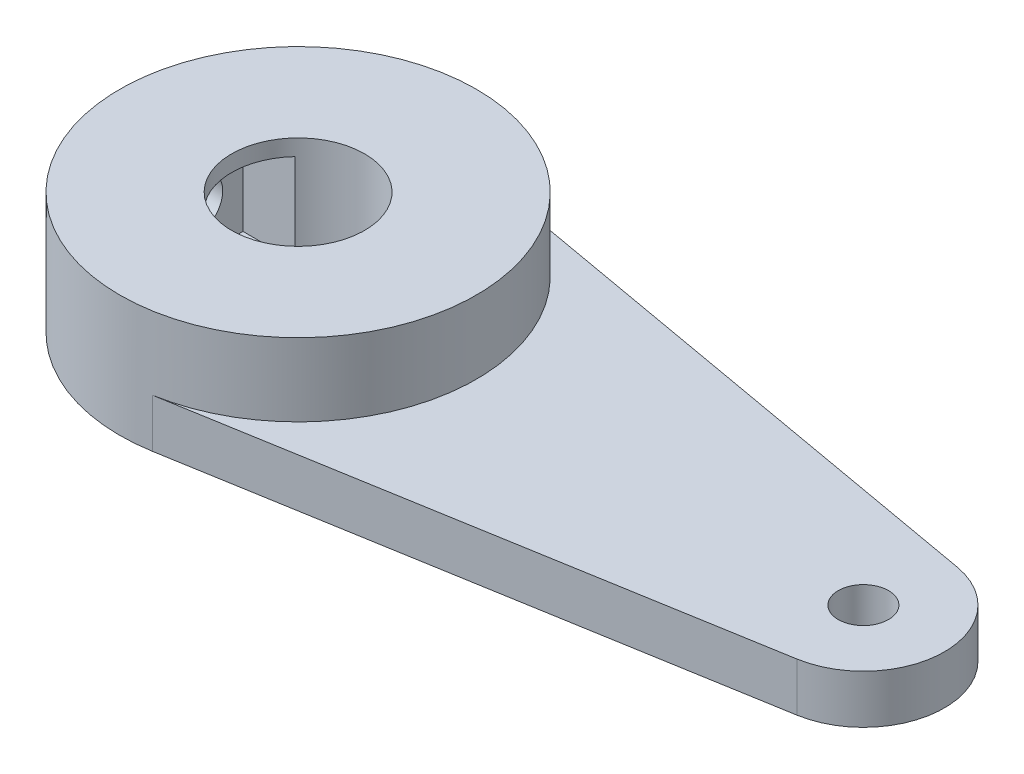
ISO-10303-21;
HEADER;
FILE_DESCRIPTION(('STEP AP214'),'2;1');
FILE_NAME('part.step','',(''),(''),'','','');
FILE_SCHEMA(('AUTOMOTIVE_DESIGN { 1 0 10303 214 1 1 1 1 }'));
ENDSEC;
DATA;
#1=APPLICATION_CONTEXT('core data for automotive mechanical design processes');
#2=APPLICATION_PROTOCOL_DEFINITION('international standard','automotive_design',2000,#1);
#3=PRODUCT_CONTEXT('',#1,'mechanical');
#4=PRODUCT('Part','Part','',(#3));
#5=PRODUCT_RELATED_PRODUCT_CATEGORY('part','',(#4));
#6=PRODUCT_DEFINITION_FORMATION('','',#4);
#7=PRODUCT_DEFINITION_CONTEXT('part definition',#1,'design');
#8=PRODUCT_DEFINITION('design','',#6,#7);
#9=PRODUCT_DEFINITION_SHAPE('','',#8);
#10=(LENGTH_UNIT() NAMED_UNIT(*) SI_UNIT(.MILLI.,.METRE.));
#11=(NAMED_UNIT(*) PLANE_ANGLE_UNIT() SI_UNIT($,.RADIAN.));
#12=(NAMED_UNIT(*) SI_UNIT($,.STERADIAN.) SOLID_ANGLE_UNIT());
#13=UNCERTAINTY_MEASURE_WITH_UNIT(LENGTH_MEASURE(1.E-05),#10,'distance_accuracy_value','');
#14=(GEOMETRIC_REPRESENTATION_CONTEXT(3) GLOBAL_UNCERTAINTY_ASSIGNED_CONTEXT((#13)) GLOBAL_UNIT_ASSIGNED_CONTEXT((#10,
#11,#12)) REPRESENTATION_CONTEXT('',''));
#15=CARTESIAN_POINT('',(0.,0.,0.));
#16=DIRECTION('',(0.,0.,1.));
#17=DIRECTION('',(1.,0.,0.));
#18=AXIS2_PLACEMENT_3D('',#15,#16,#17);
#19=CARTESIAN_POINT('',(0.,3.,0.));
#20=DIRECTION('',(0.,-1.,0.));
#21=DIRECTION('',(0.,0.,-1.));
#22=AXIS2_PLACEMENT_3D('',#19,#20,#21);
#23=CYLINDRICAL_SURFACE('',#22,11.);
#24=CARTESIAN_POINT('',(-11.,2.15,0.));
#25=CARTESIAN_POINT('',(-10.999998672925,2.15000361570064,-0.0866040264908461));
#26=CARTESIAN_POINT('',(-10.9989664869563,2.15728280643543,-0.173259794626831));
#27=CARTESIAN_POINT('',(-10.9949482100143,2.18620223688388,-0.344153330429826));
#28=CARTESIAN_POINT('',(-10.9919601636256,2.20785684905631,-0.428388590064779));
#29=CARTESIAN_POINT('',(-10.9843662745584,2.26487074748938,-0.591942867532755));
#30=CARTESIAN_POINT('',(-10.9797616037502,2.30022010851824,-0.671265397672689));
#31=CARTESIAN_POINT('',(-10.9694445515703,2.38359675135245,-0.82283940083507));
#32=CARTESIAN_POINT('',(-10.9637323378879,2.43162211432342,-0.895091941812521));
#33=CARTESIAN_POINT('',(-10.9517921420267,2.53934243122362,-1.03098880457318));
#34=CARTESIAN_POINT('',(-10.945561185276,2.59910780054263,-1.09457705522546));
#35=CARTESIAN_POINT('',(-10.9333093188318,2.72846016726637,-1.21085684580095));
#36=CARTESIAN_POINT('',(-10.9272884206848,2.79804770352853,-1.26354778749173));
#37=CARTESIAN_POINT('',(-10.9161094077342,2.94544129041762,-1.35675208502266));
#38=CARTESIAN_POINT('',(-10.910955134486,3.02328156273434,-1.39721182318942));
#39=CARTESIAN_POINT('',(-10.902133119172,3.18473724933349,-1.46446265999459));
#40=CARTESIAN_POINT('',(-10.8984653056527,3.26835238579418,-1.49125441566378));
#41=CARTESIAN_POINT('',(-10.8930604704617,3.43839728152154,-1.53023599682836));
#42=CARTESIAN_POINT('',(-10.8913108222432,3.52480473225743,-1.5425213541803));
#43=CARTESIAN_POINT('',(-10.8899019866824,3.69847116118864,-1.55243722231747));
#44=CARTESIAN_POINT('',(-10.890242693197,3.78573009592304,-1.5500684772021));
#45=CARTESIAN_POINT('',(-10.8929645198383,3.95795119210427,-1.53082158306399));
#46=CARTESIAN_POINT('',(-10.8953307405418,4.04292546308658,-1.51404938113104));
#47=CARTESIAN_POINT('',(-10.9018137246243,4.20884142025132,-1.46663731432665));
#48=CARTESIAN_POINT('',(-10.9059305321673,4.2897830046392,-1.43599709959037));
#49=CARTESIAN_POINT('',(-10.9154674597461,4.44566090916432,-1.36160716939729));
#50=CARTESIAN_POINT('',(-10.920892072566,4.52057531408944,-1.31781213197892));
#51=CARTESIAN_POINT('',(-10.9324300673764,4.66203191903368,-1.21838806763531));
#52=CARTESIAN_POINT('',(-10.9385434893145,4.72857363300284,-1.16275835418954));
#53=CARTESIAN_POINT('',(-10.9508362680828,4.85201037141765,-1.04066034641347));
#54=CARTESIAN_POINT('',(-10.9570157312566,4.90881523271891,-0.974100871831585));
#55=CARTESIAN_POINT('',(-10.9686941635756,5.01046132800483,-0.832344701826548));
#56=CARTESIAN_POINT('',(-10.9741931303394,5.05530252012217,-0.757147976178332));
#57=CARTESIAN_POINT('',(-10.9838957854881,5.13175127238931,-0.600177025011197));
#58=CARTESIAN_POINT('',(-10.9880988420774,5.16335238028128,-0.518399615630176));
#59=CARTESIAN_POINT('',(-10.9947306787688,5.21234816595864,-0.350626424965284));
#60=CARTESIAN_POINT('',(-10.9971595646028,5.22974369033481,-0.264630895386803));
#61=CARTESIAN_POINT('',(-10.9999554893663,5.24971578855354,-0.0916412747048413));
#62=CARTESIAN_POINT('',(-11.0003397874951,5.25241641247539,-0.00466177390345783));
#63=CARTESIAN_POINT('',(-10.9990500716365,5.24325058739078,0.168508732856678));
#64=CARTESIAN_POINT('',(-10.9973761136821,5.23138453493984,0.254699760216063));
#65=CARTESIAN_POINT('',(-10.9921686644742,5.19352531364729,0.423474653918695));
#66=CARTESIAN_POINT('',(-10.9886430654084,5.16759208756554,0.506072230830925));
#67=CARTESIAN_POINT('',(-10.9801265962505,5.10239753699855,0.665746677944593));
#68=CARTESIAN_POINT('',(-10.9751356644738,5.0631356514217,0.742823315567664));
#69=CARTESIAN_POINT('',(-10.9642008521073,4.97210376434156,0.889816734561455));
#70=CARTESIAN_POINT('',(-10.9582510145372,4.9202544744585,0.959683962168675));
#71=CARTESIAN_POINT('',(-10.9460805582873,4.80563065771206,1.08976922149313));
#72=CARTESIAN_POINT('',(-10.9398599258206,4.74285557409361,1.14998676118245));
#73=CARTESIAN_POINT('',(-10.9277948151625,4.60761205623004,1.25951036751739));
#74=CARTESIAN_POINT('',(-10.9219534122386,4.53507624633949,1.30873362586126));
#75=CARTESIAN_POINT('',(-10.9113611444075,4.38269334147099,1.39429716907009));
#76=CARTESIAN_POINT('',(-10.906610252839,4.30284642530513,1.43063776890808));
#77=CARTESIAN_POINT('',(-10.8987587198508,4.13836255809665,1.48927386236083));
#78=CARTESIAN_POINT('',(-10.8956528232782,4.05374182809164,1.51161412432486));
#79=CARTESIAN_POINT('',(-10.89142856138,3.88190287242822,1.54175856090802));
#80=CARTESIAN_POINT('',(-10.890310076226,3.79468480369545,1.54956361191048));
#81=CARTESIAN_POINT('',(-10.8901913855878,3.62095169802355,1.55039704678824));
#82=CARTESIAN_POINT('',(-10.8911725223973,3.53443726980281,1.54355558262746));
#83=CARTESIAN_POINT('',(-10.8951021462507,3.36380190651386,1.51556783361755));
#84=CARTESIAN_POINT('',(-10.8980506315503,3.27968096932366,1.49442156145098));
#85=CARTESIAN_POINT('',(-10.9055764978237,3.11624931636455,1.43846848261944));
#86=CARTESIAN_POINT('',(-10.9101529220596,3.03693580725103,1.40366969828592));
#87=CARTESIAN_POINT('',(-10.9204203284971,2.88525214861912,1.32141223851242));
#88=CARTESIAN_POINT('',(-10.9261113394141,2.81288217806173,1.27395323689028));
#89=CARTESIAN_POINT('',(-10.9380270606933,2.67647697474319,1.16724566741457));
#90=CARTESIAN_POINT('',(-10.944255891724,2.61251771528433,1.10790043280045));
#91=CARTESIAN_POINT('',(-10.9565102460325,2.49541827497348,0.979308846420642));
#92=CARTESIAN_POINT('',(-10.9625357214848,2.44228062457565,0.910060185331665));
#93=CARTESIAN_POINT('',(-10.9737373767081,2.34810684593979,0.763236753228444));
#94=CARTESIAN_POINT('',(-10.9789093113759,2.30713044157717,0.685623362033751));
#95=CARTESIAN_POINT('',(-10.9877791444811,2.23885454721489,0.52458254658608));
#96=CARTESIAN_POINT('',(-10.991478597728,2.21154062298357,0.441161364823184));
#97=CARTESIAN_POINT('',(-10.9961238598794,2.17769373882488,0.297785879526305));
#98=CARTESIAN_POINT('',(-10.9975700961975,2.16732408927133,0.238724404122719));
#99=CARTESIAN_POINT('',(-10.9995086202997,2.15347600496575,0.119783532123804));
#100=CARTESIAN_POINT('',(-11.0000009179399,2.14999749901407,0.0599041439856297));
#101=CARTESIAN_POINT('',(-11.,2.15,0.));
#102=B_SPLINE_CURVE_WITH_KNOTS('',3,(#24,#25,#26,#27,#28,#29,#30,#31,#32,#33,#34,#35,#36,#37,
#38,#39,#40,#41,#42,#43,#44,#45,#46,#47,#48,#49,#50,#51,#52,#53,#54,#55,#56,#57,#58,#59,#60,#61,
#62,#63,#64,#65,#66,#67,#68,#69,#70,#71,#72,#73,#74,#75,#76,#77,#78,#79,#80,#81,#82,#83,#84,#85,
#86,#87,#88,#89,#90,#91,#92,#93,#94,#95,#96,#97,#98,#99,#100,#101),.UNSPECIFIED.,.T.,.F.,(4,2,2,
2,2,2,2,2,2,2,2,2,2,2,2,2,2,2,2,2,2,2,2,2,2,2,2,2,2,2,2,2,2,2,2,2,2,2,4),(0.,0.259593216845466,
0.519446365076941,0.779111536704161,1.03873742394281,1.2999708822415,1.56121867773751,
1.82359562543898,2.08595995928316,2.34658668231909,2.60720017147757,2.86591293444981,
3.12463222464023,3.38425330169916,3.64388944328776,3.90581324569052,4.16773796469342,
4.4297901787775,4.6918267745534,4.95164786161353,5.2114618755981,5.47017737412035,
5.72890376504332,5.98930421074471,6.24971792978218,6.5120314664615,6.77433858929474,
7.0358026044493,7.29725085443003,7.55638547009205,7.81551985600735,8.07450219988342,
8.33349121691325,8.5946789137681,8.85592761509376,9.11843884929079,9.38067215491185,
9.56023505450156,9.73979609882838),.UNSPECIFIED.);
#103=CARTESIAN_POINT('',(-11.,2.15,0.));
#104=VERTEX_POINT('',#103);
#105=EDGE_CURVE('E132',#104,#104,#102,.T.);
#106=ORIENTED_EDGE('',*,*,#105,.T.);
#107=EDGE_LOOP('',(#106));
#108=FACE_BOUND('',#107,.T.);
#109=CARTESIAN_POINT('',(0.,0.,0.));
#110=DIRECTION('',(0.,1.,0.));
#111=DIRECTION('',(0.,0.,1.));
#112=AXIS2_PLACEMENT_3D('',#109,#110,#111);
#113=CIRCLE('',#112,11.);
#114=CARTESIAN_POINT('',(1.92456037559768,0.,-10.8303308980233));
#115=VERTEX_POINT('',#114);
#116=CARTESIAN_POINT('',(1.84681967687242,0.,10.8438580349024));
#117=VERTEX_POINT('',#116);
#118=EDGE_CURVE('E165',#115,#117,#113,.T.);
#119=ORIENTED_EDGE('',*,*,#118,.T.);
#120=DIRECTION('',(0.,-1.,0.));
#121=VECTOR('',#120,1.);
#122=CARTESIAN_POINT('',(1.84681967687242,3.,10.8438580349024));
#123=LINE('',#122,#121);
#124=CARTESIAN_POINT('',(1.84681967687242,3.,10.8438580349024));
#125=VERTEX_POINT('',#124);
#126=EDGE_CURVE('E186',#125,#117,#123,.T.);
#127=ORIENTED_EDGE('',*,*,#126,.F.);
#128=CARTESIAN_POINT('',(0.,3.,0.));
#129=DIRECTION('',(0.,1.,0.));
#130=DIRECTION('',(0.,0.,1.));
#131=AXIS2_PLACEMENT_3D('',#128,#129,#130);
#132=CIRCLE('',#131,11.);
#133=CARTESIAN_POINT('',(1.92456037559768,3.,-10.8303308980233));
#134=VERTEX_POINT('',#133);
#135=EDGE_CURVE('E161',#125,#134,#132,.T.);
#136=ORIENTED_EDGE('',*,*,#135,.T.);
#137=DIRECTION('',(0.,-1.,0.));
#138=VECTOR('',#137,1.);
#139=CARTESIAN_POINT('',(1.92456037559768,3.,-10.8303308980233));
#140=LINE('',#139,#138);
#141=EDGE_CURVE('E172',#134,#115,#140,.T.);
#142=ORIENTED_EDGE('',*,*,#141,.T.);
#143=EDGE_LOOP('',(#119,#127,#136,#142));
#144=FACE_BOUND('',#143,.T.);
#145=CARTESIAN_POINT('',(0.,7.5,0.));
#146=DIRECTION('',(0.,1.,0.));
#147=DIRECTION('',(0.,0.,1.));
#148=AXIS2_PLACEMENT_3D('',#145,#146,#147);
#149=CIRCLE('',#148,11.);
#150=CARTESIAN_POINT('',(0.,7.5,11.));
#151=VERTEX_POINT('',#150);
#152=EDGE_CURVE('E162',#151,#151,#149,.T.);
#153=ORIENTED_EDGE('',*,*,#152,.F.);
#154=EDGE_LOOP('',(#153));
#155=FACE_BOUND('',#154,.T.);
#156=ADVANCED_FACE('F38',(#108,#144,#155),#23,.T.);
#157=CARTESIAN_POINT('',(35.8394634894875,3.,5.05456392389569));
#158=DIRECTION('',(-0.167892697897493,0.,-0.985805275900216));
#159=DIRECTION('',(-0.985805275900216,0.,0.167892697897493));
#160=AXIS2_PLACEMENT_3D('',#157,#158,#159);
#161=PLANE('',#160);
#162=DIRECTION('',(0.985805275900216,0.,-0.167892697897493));
#163=VECTOR('',#162,1.);
#164=CARTESIAN_POINT('',(35.8394634894875,0.,5.05456392389569));
#165=LINE('',#164,#163);
#166=CARTESIAN_POINT('',(35.8394634894875,0.,5.05456392389569));
#167=VERTEX_POINT('',#166);
#168=EDGE_CURVE('E175',#117,#167,#165,.T.);
#169=ORIENTED_EDGE('',*,*,#168,.T.);
#170=DIRECTION('',(0.,-1.,0.));
#171=VECTOR('',#170,1.);
#172=CARTESIAN_POINT('',(35.8394634894875,3.,5.05456392389569));
#173=LINE('',#172,#171);
#174=CARTESIAN_POINT('',(35.8394634894875,3.,5.05456392389569));
#175=VERTEX_POINT('',#174);
#176=EDGE_CURVE('E183',#175,#167,#173,.T.);
#177=ORIENTED_EDGE('',*,*,#176,.F.);
#178=DIRECTION('',(0.985805275900216,0.,-0.167892697897493));
#179=VECTOR('',#178,1.);
#180=CARTESIAN_POINT('',(35.8394634894875,3.,5.05456392389569));
#181=LINE('',#180,#179);
#182=EDGE_CURVE('E87',#125,#175,#181,.T.);
#183=ORIENTED_EDGE('',*,*,#182,.F.);
#184=ORIENTED_EDGE('',*,*,#126,.T.);
#185=EDGE_LOOP('',(#169,#177,#183,#184));
#186=FACE_BOUND('',#185,.T.);
#187=ADVANCED_FACE('F211',(#186),#161,.F.);
#188=CARTESIAN_POINT('',(35.,3.,0.125537544394609));
#189=DIRECTION('',(0.,-1.,0.));
#190=DIRECTION('',(0.,0.,-1.));
#191=AXIS2_PLACEMENT_3D('',#188,#189,#190);
#192=CYLINDRICAL_SURFACE('',#191,5.);
#193=CARTESIAN_POINT('',(35.,0.,0.125537544394609));
#194=DIRECTION('',(0.,1.,0.));
#195=DIRECTION('',(0.,0.,-1.));
#196=AXIS2_PLACEMENT_3D('',#193,#194,#195);
#197=CIRCLE('',#196,5.);
#198=CARTESIAN_POINT('',(35.8748001707262,0.,-4.79734013652509));
#199=VERTEX_POINT('',#198);
#200=EDGE_CURVE('E177',#167,#199,#197,.T.);
#201=ORIENTED_EDGE('',*,*,#200,.T.);
#202=DIRECTION('',(0.,-1.,0.));
#203=VECTOR('',#202,1.);
#204=CARTESIAN_POINT('',(35.8748001707262,3.,-4.79734013652509));
#205=LINE('',#204,#203);
#206=CARTESIAN_POINT('',(35.8748001707262,3.,-4.79734013652509));
#207=VERTEX_POINT('',#206);
#208=EDGE_CURVE('E181',#207,#199,#205,.T.);
#209=ORIENTED_EDGE('',*,*,#208,.F.);
#210=CARTESIAN_POINT('',(35.,3.,0.125537544394609));
#211=DIRECTION('',(0.,1.,0.));
#212=DIRECTION('',(0.,0.,-1.));
#213=AXIS2_PLACEMENT_3D('',#210,#211,#212);
#214=CIRCLE('',#213,5.);
#215=EDGE_CURVE('E169',#175,#207,#214,.T.);
#216=ORIENTED_EDGE('',*,*,#215,.F.);
#217=ORIENTED_EDGE('',*,*,#176,.T.);
#218=EDGE_LOOP('',(#201,#209,#216,#217));
#219=FACE_BOUND('',#218,.T.);
#220=ADVANCED_FACE('F216',(#219),#192,.T.);
#221=CARTESIAN_POINT('',(1.92456037559768,3.,-10.8303308980233));
#222=DIRECTION('',(-0.174960034145244,0.,0.984575536183941));
#223=DIRECTION('',(0.984575536183941,0.,0.174960034145244));
#224=AXIS2_PLACEMENT_3D('',#221,#222,#223);
#225=PLANE('',#224);
#226=DIRECTION('',(-0.984575536183941,0.,-0.174960034145244));
#227=VECTOR('',#226,1.);
#228=CARTESIAN_POINT('',(1.92456037559768,0.,-10.8303308980233));
#229=LINE('',#228,#227);
#230=EDGE_CURVE('E83',#199,#115,#229,.T.);
#231=ORIENTED_EDGE('',*,*,#230,.T.);
#232=ORIENTED_EDGE('',*,*,#141,.F.);
#233=DIRECTION('',(-0.984575536183941,0.,-0.174960034145244));
#234=VECTOR('',#233,1.);
#235=CARTESIAN_POINT('',(1.92456037559768,3.,-10.8303308980233));
#236=LINE('',#235,#234);
#237=EDGE_CURVE('E63',#207,#134,#236,.T.);
#238=ORIENTED_EDGE('',*,*,#237,.F.);
#239=ORIENTED_EDGE('',*,*,#208,.T.);
#240=EDGE_LOOP('',(#231,#232,#238,#239));
#241=FACE_BOUND('',#240,.T.);
#242=ADVANCED_FACE('F241',(#241),#225,.F.);
#243=CARTESIAN_POINT('',(0.,3.,0.));
#244=DIRECTION('',(0.,1.,0.));
#245=DIRECTION('',(0.,0.,1.));
#246=AXIS2_PLACEMENT_3D('',#243,#244,#245);
#247=PLANE('',#246);
#248=CARTESIAN_POINT('',(35.,3.,0.125537544394609));
#249=DIRECTION('',(0.,1.,0.));
#250=DIRECTION('',(0.,0.,1.));
#251=AXIS2_PLACEMENT_3D('',#248,#249,#250);
#252=CIRCLE('',#251,1.55);
#253=CARTESIAN_POINT('',(35.,3.,1.67553754439461));
#254=VERTEX_POINT('',#253);
#255=EDGE_CURVE('E153',#254,#254,#252,.T.);
#256=ORIENTED_EDGE('',*,*,#255,.F.);
#257=EDGE_LOOP('',(#256));
#258=FACE_BOUND('',#257,.T.);
#259=ORIENTED_EDGE('',*,*,#135,.F.);
#260=ORIENTED_EDGE('',*,*,#182,.T.);
#261=ORIENTED_EDGE('',*,*,#215,.T.);
#262=ORIENTED_EDGE('',*,*,#237,.T.);
#263=EDGE_LOOP('',(#259,#260,#261,#262));
#264=FACE_BOUND('',#263,.T.);
#265=ADVANCED_FACE('F235',(#258,#264),#247,.T.);
#266=CARTESIAN_POINT('',(0.,0.,0.));
#267=DIRECTION('',(0.,1.,0.));
#268=DIRECTION('',(0.,0.,1.));
#269=AXIS2_PLACEMENT_3D('',#266,#267,#268);
#270=PLANE('',#269);
#271=CARTESIAN_POINT('',(0.,0.,0.));
#272=DIRECTION('',(0.,-1.,0.));
#273=DIRECTION('',(0.,0.,-1.));
#274=AXIS2_PLACEMENT_3D('',#271,#272,#273);
#275=CIRCLE('',#274,4.1);
#276=CARTESIAN_POINT('',(0.,0.,-4.1));
#277=VERTEX_POINT('',#276);
#278=EDGE_CURVE('E154',#277,#277,#275,.T.);
#279=ORIENTED_EDGE('',*,*,#278,.F.);
#280=EDGE_LOOP('',(#279));
#281=FACE_BOUND('',#280,.T.);
#282=CARTESIAN_POINT('',(35.,0.,0.125537544394609));
#283=DIRECTION('',(0.,-1.,0.));
#284=DIRECTION('',(0.,0.,-1.));
#285=AXIS2_PLACEMENT_3D('',#282,#283,#284);
#286=CIRCLE('',#285,1.55);
#287=CARTESIAN_POINT('',(35.,0.,-1.42446245560539));
#288=VERTEX_POINT('',#287);
#289=EDGE_CURVE('E145',#288,#288,#286,.T.);
#290=ORIENTED_EDGE('',*,*,#289,.F.);
#291=EDGE_LOOP('',(#290));
#292=FACE_BOUND('',#291,.T.);
#293=ORIENTED_EDGE('',*,*,#118,.F.);
#294=ORIENTED_EDGE('',*,*,#230,.F.);
#295=ORIENTED_EDGE('',*,*,#200,.F.);
#296=ORIENTED_EDGE('',*,*,#168,.F.);
#297=EDGE_LOOP('',(#293,#294,#295,#296));
#298=FACE_BOUND('',#297,.T.);
#299=ADVANCED_FACE('F226',(#281,#292,#298),#270,.F.);
#300=CARTESIAN_POINT('',(0.,7.5,0.));
#301=DIRECTION('',(0.,1.,0.));
#302=DIRECTION('',(0.,0.,1.));
#303=AXIS2_PLACEMENT_3D('',#300,#301,#302);
#304=PLANE('',#303);
#305=CARTESIAN_POINT('',(0.,7.5,0.));
#306=DIRECTION('',(0.,-1.,0.));
#307=DIRECTION('',(0.,0.,-1.));
#308=AXIS2_PLACEMENT_3D('',#305,#306,#307);
#309=CIRCLE('',#308,4.1);
#310=CARTESIAN_POINT('',(0.,7.5,-4.1));
#311=VERTEX_POINT('',#310);
#312=EDGE_CURVE('E150',#311,#311,#309,.T.);
#313=ORIENTED_EDGE('',*,*,#312,.T.);
#314=EDGE_LOOP('',(#313));
#315=FACE_BOUND('',#314,.T.);
#316=ORIENTED_EDGE('',*,*,#152,.T.);
#317=EDGE_LOOP('',(#316));
#318=FACE_BOUND('',#317,.T.);
#319=ADVANCED_FACE('F224',(#315,#318),#304,.T.);
#320=CARTESIAN_POINT('',(0.,7.5,0.));
#321=DIRECTION('',(0.,-1.,0.));
#322=DIRECTION('',(0.,0.,-1.));
#323=AXIS2_PLACEMENT_3D('',#320,#321,#322);
#324=CYLINDRICAL_SURFACE('',#323,4.1);
#325=CARTESIAN_POINT('',(0.,6.5,0.));
#326=DIRECTION('',(0.,1.,0.));
#327=DIRECTION('',(0.,0.,1.));
#328=AXIS2_PLACEMENT_3D('',#325,#326,#327);
#329=CIRCLE('',#328,4.1);
#330=CARTESIAN_POINT('',(-2.99499582637438,6.5,2.8));
#331=VERTEX_POINT('',#330);
#332=CARTESIAN_POINT('',(-2.99499582637439,6.5,-2.8));
#333=VERTEX_POINT('',#332);
#334=EDGE_CURVE('E189',#331,#333,#329,.F.);
#335=ORIENTED_EDGE('',*,*,#334,.T.);
#336=DIRECTION('',(0.,-1.,0.));
#337=VECTOR('',#336,1.);
#338=CARTESIAN_POINT('',(-2.99499582637439,7.5,-2.8));
#339=LINE('',#338,#337);
#340=CARTESIAN_POINT('',(-2.99499582637439,0.900000000000001,-2.8));
#341=VERTEX_POINT('',#340);
#342=EDGE_CURVE('E11',#333,#341,#339,.T.);
#343=ORIENTED_EDGE('',*,*,#342,.T.);
#344=CARTESIAN_POINT('',(0.,0.900000000000001,0.));
#345=DIRECTION('',(0.,-1.,0.));
#346=DIRECTION('',(0.,0.,-1.));
#347=AXIS2_PLACEMENT_3D('',#344,#345,#346);
#348=CIRCLE('',#347,4.1);
#349=CARTESIAN_POINT('',(-2.99499582637438,0.900000000000001,2.8));
#350=VERTEX_POINT('',#349);
#351=EDGE_CURVE('E47',#341,#350,#348,.F.);
#352=ORIENTED_EDGE('',*,*,#351,.T.);
#353=DIRECTION('',(0.,-1.,0.));
#354=VECTOR('',#353,1.);
#355=CARTESIAN_POINT('',(-2.99499582637438,7.5,2.8));
#356=LINE('',#355,#354);
#357=EDGE_CURVE('E191',#350,#331,#356,.F.);
#358=ORIENTED_EDGE('',*,*,#357,.T.);
#359=EDGE_LOOP('',(#335,#343,#352,#358));
#360=FACE_BOUND('',#359,.T.);
#361=ORIENTED_EDGE('',*,*,#312,.F.);
#362=EDGE_LOOP('',(#361));
#363=FACE_BOUND('',#362,.T.);
#364=ORIENTED_EDGE('',*,*,#278,.T.);
#365=EDGE_LOOP('',(#364));
#366=FACE_BOUND('',#365,.T.);
#367=ADVANCED_FACE('F196',(#360,#363,#366),#324,.F.);
#368=CARTESIAN_POINT('',(35.,7.5,0.125537544394609));
#369=DIRECTION('',(0.,-1.,0.));
#370=DIRECTION('',(0.,0.,-1.));
#371=AXIS2_PLACEMENT_3D('',#368,#369,#370);
#372=CYLINDRICAL_SURFACE('',#371,1.55);
#373=ORIENTED_EDGE('',*,*,#255,.T.);
#374=EDGE_LOOP('',(#373));
#375=FACE_BOUND('',#374,.T.);
#376=ORIENTED_EDGE('',*,*,#289,.T.);
#377=EDGE_LOOP('',(#376));
#378=FACE_BOUND('',#377,.T.);
#379=ADVANCED_FACE('F233',(#375,#378),#372,.F.);
#380=CARTESIAN_POINT('',(-6.2,6.5,-2.8));
#381=DIRECTION('',(0.,0.,-1.));
#382=DIRECTION('',(0.,1.,0.));
#383=AXIS2_PLACEMENT_3D('',#380,#381,#382);
#384=PLANE('',#383);
#385=DIRECTION('',(1.,0.,0.));
#386=VECTOR('',#385,1.);
#387=CARTESIAN_POINT('',(-6.2,6.5,-2.8));
#388=LINE('',#387,#386);
#389=CARTESIAN_POINT('',(-6.2,6.5,-2.8));
#390=VERTEX_POINT('',#389);
#391=EDGE_CURVE('E54',#390,#333,#388,.T.);
#392=ORIENTED_EDGE('',*,*,#391,.F.);
#393=DIRECTION('',(0.,1.,0.));
#394=VECTOR('',#393,1.);
#395=CARTESIAN_POINT('',(-6.2,6.5,-2.8));
#396=LINE('',#395,#394);
#397=CARTESIAN_POINT('',(-6.2,0.900000000000001,-2.8));
#398=VERTEX_POINT('',#397);
#399=EDGE_CURVE('E115',#398,#390,#396,.T.);
#400=ORIENTED_EDGE('',*,*,#399,.F.);
#401=DIRECTION('',(1.,0.,0.));
#402=VECTOR('',#401,1.);
#403=CARTESIAN_POINT('',(-6.2,0.900000000000001,-2.8));
#404=LINE('',#403,#402);
#405=EDGE_CURVE('E143',#398,#341,#404,.T.);
#406=ORIENTED_EDGE('',*,*,#405,.T.);
#407=ORIENTED_EDGE('',*,*,#342,.F.);
#408=EDGE_LOOP('',(#392,#400,#406,#407));
#409=FACE_BOUND('',#408,.T.);
#410=ADVANCED_FACE('F112',(#409),#384,.F.);
#411=CARTESIAN_POINT('',(-6.2,0.900000000000001,2.8));
#412=DIRECTION('',(0.,-1.,0.));
#413=DIRECTION('',(0.,0.,-1.));
#414=AXIS2_PLACEMENT_3D('',#411,#412,#413);
#415=PLANE('',#414);
#416=ORIENTED_EDGE('',*,*,#405,.F.);
#417=DIRECTION('',(0.,0.,-1.));
#418=VECTOR('',#417,1.);
#419=CARTESIAN_POINT('',(-6.2,0.900000000000001,2.8));
#420=LINE('',#419,#418);
#421=CARTESIAN_POINT('',(-6.2,0.900000000000001,2.8));
#422=VERTEX_POINT('',#421);
#423=EDGE_CURVE('E119',#422,#398,#420,.T.);
#424=ORIENTED_EDGE('',*,*,#423,.F.);
#425=DIRECTION('',(1.,0.,0.));
#426=VECTOR('',#425,1.);
#427=CARTESIAN_POINT('',(-6.2,0.900000000000001,2.8));
#428=LINE('',#427,#426);
#429=EDGE_CURVE('E146',#422,#350,#428,.T.);
#430=ORIENTED_EDGE('',*,*,#429,.T.);
#431=ORIENTED_EDGE('',*,*,#351,.F.);
#432=EDGE_LOOP('',(#416,#424,#430,#431));
#433=FACE_BOUND('',#432,.T.);
#434=ADVANCED_FACE('F199',(#433),#415,.F.);
#435=CARTESIAN_POINT('',(-6.2,6.5,2.8));
#436=DIRECTION('',(0.,0.,1.));
#437=DIRECTION('',(0.,-1.,0.));
#438=AXIS2_PLACEMENT_3D('',#435,#436,#437);
#439=PLANE('',#438);
#440=ORIENTED_EDGE('',*,*,#429,.F.);
#441=DIRECTION('',(0.,-1.,0.));
#442=VECTOR('',#441,1.);
#443=CARTESIAN_POINT('',(-6.2,6.5,2.8));
#444=LINE('',#443,#442);
#445=CARTESIAN_POINT('',(-6.2,6.5,2.8));
#446=VERTEX_POINT('',#445);
#447=EDGE_CURVE('E128',#446,#422,#444,.T.);
#448=ORIENTED_EDGE('',*,*,#447,.F.);
#449=DIRECTION('',(1.,0.,0.));
#450=VECTOR('',#449,1.);
#451=CARTESIAN_POINT('',(-6.2,6.5,2.8));
#452=LINE('',#451,#450);
#453=EDGE_CURVE('E118',#446,#331,#452,.T.);
#454=ORIENTED_EDGE('',*,*,#453,.T.);
#455=ORIENTED_EDGE('',*,*,#357,.F.);
#456=EDGE_LOOP('',(#440,#448,#454,#455));
#457=FACE_BOUND('',#456,.T.);
#458=ADVANCED_FACE('F201',(#457),#439,.F.);
#459=CARTESIAN_POINT('',(-6.2,6.5,2.8));
#460=DIRECTION('',(0.,1.,0.));
#461=DIRECTION('',(0.,0.,1.));
#462=AXIS2_PLACEMENT_3D('',#459,#460,#461);
#463=PLANE('',#462);
#464=ORIENTED_EDGE('',*,*,#453,.F.);
#465=DIRECTION('',(0.,0.,1.));
#466=VECTOR('',#465,1.);
#467=CARTESIAN_POINT('',(-6.2,6.5,2.8));
#468=LINE('',#467,#466);
#469=EDGE_CURVE('E122',#390,#446,#468,.T.);
#470=ORIENTED_EDGE('',*,*,#469,.F.);
#471=ORIENTED_EDGE('',*,*,#391,.T.);
#472=ORIENTED_EDGE('',*,*,#334,.F.);
#473=EDGE_LOOP('',(#464,#470,#471,#472));
#474=FACE_BOUND('',#473,.T.);
#475=ADVANCED_FACE('F123',(#474),#463,.F.);
#476=CARTESIAN_POINT('',(-6.2,0.,0.));
#477=DIRECTION('',(1.,0.,0.));
#478=DIRECTION('',(0.,0.,-1.));
#479=AXIS2_PLACEMENT_3D('',#476,#477,#478);
#480=PLANE('',#479);
#481=CARTESIAN_POINT('',(-6.2,3.7,0.));
#482=DIRECTION('',(1.,0.,0.));
#483=DIRECTION('',(0.,0.,-1.));
#484=AXIS2_PLACEMENT_3D('',#481,#482,#483);
#485=CIRCLE('',#484,1.55);
#486=CARTESIAN_POINT('',(-6.2,3.7,-1.55));
#487=VERTEX_POINT('',#486);
#488=EDGE_CURVE('E42',#487,#487,#485,.T.);
#489=ORIENTED_EDGE('',*,*,#488,.F.);
#490=EDGE_LOOP('',(#489));
#491=FACE_BOUND('',#490,.T.);
#492=ORIENTED_EDGE('',*,*,#399,.T.);
#493=ORIENTED_EDGE('',*,*,#469,.T.);
#494=ORIENTED_EDGE('',*,*,#447,.T.);
#495=ORIENTED_EDGE('',*,*,#423,.T.);
#496=EDGE_LOOP('',(#492,#493,#494,#495));
#497=FACE_BOUND('',#496,.T.);
#498=ADVANCED_FACE('F130',(#491,#497),#480,.T.);
#499=CARTESIAN_POINT('',(-11.,3.7,0.));
#500=DIRECTION('',(1.,0.,0.));
#501=DIRECTION('',(0.,0.,-1.));
#502=AXIS2_PLACEMENT_3D('',#499,#500,#501);
#503=CYLINDRICAL_SURFACE('',#502,1.55);
#504=ORIENTED_EDGE('',*,*,#488,.T.);
#505=EDGE_LOOP('',(#504));
#506=FACE_BOUND('',#505,.T.);
#507=ORIENTED_EDGE('',*,*,#105,.F.);
#508=EDGE_LOOP('',(#507));
#509=FACE_BOUND('',#508,.T.);
#510=ADVANCED_FACE('F324',(#506,#509),#503,.F.);
#511=CLOSED_SHELL('',(#156,#187,#220,#242,#265,#299,#319,#367,#379,#410,#434,#458,#475,#498,#510));
#512=MANIFOLD_SOLID_BREP('B2',#511);
#513=ADVANCED_BREP_SHAPE_REPRESENTATION('',(#18,#512),#14);
#514=SHAPE_DEFINITION_REPRESENTATION(#9,#513);
ENDSEC;
END-ISO-10303-21;
